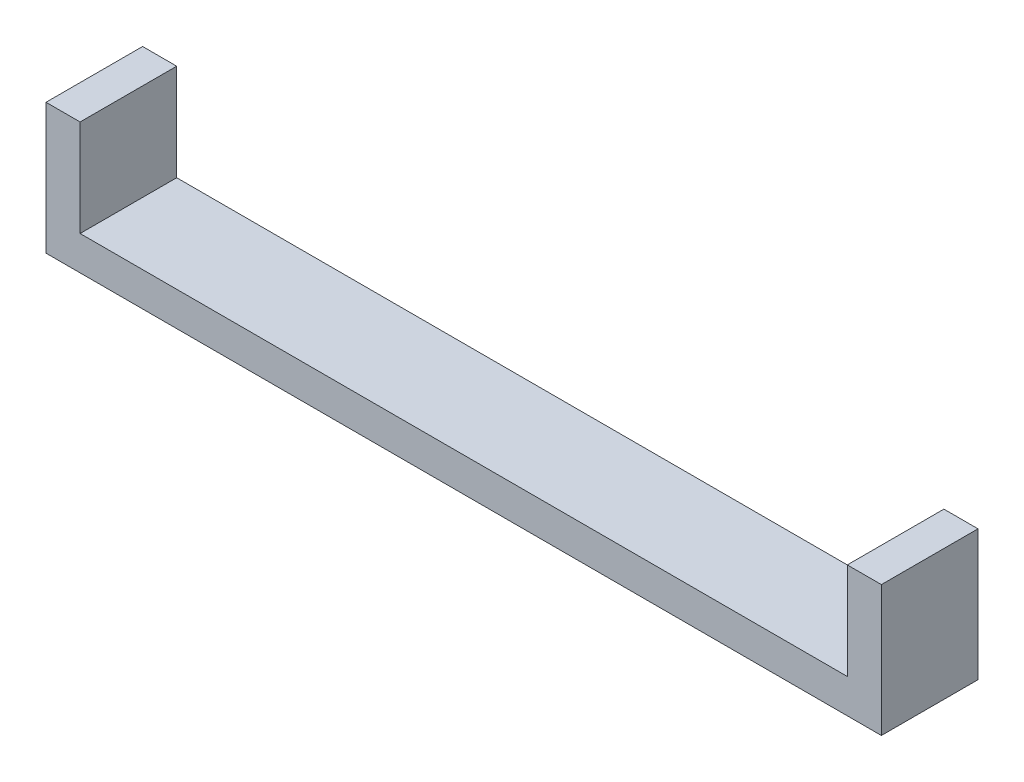
ISO-10303-21;
HEADER;
FILE_DESCRIPTION(('STEP AP214'),'2;1');
FILE_NAME('part.step','',(''),(''),'','','');
FILE_SCHEMA(('AUTOMOTIVE_DESIGN { 1 0 10303 214 1 1 1 1 }'));
ENDSEC;
DATA;
#1=APPLICATION_CONTEXT('core data for automotive mechanical design processes');
#2=APPLICATION_PROTOCOL_DEFINITION('international standard','automotive_design',2000,#1);
#3=PRODUCT_CONTEXT('',#1,'mechanical');
#4=PRODUCT('Part','Part','',(#3));
#5=PRODUCT_RELATED_PRODUCT_CATEGORY('part','',(#4));
#6=PRODUCT_DEFINITION_FORMATION('','',#4);
#7=PRODUCT_DEFINITION_CONTEXT('part definition',#1,'design');
#8=PRODUCT_DEFINITION('design','',#6,#7);
#9=PRODUCT_DEFINITION_SHAPE('','',#8);
#10=(LENGTH_UNIT() NAMED_UNIT(*) SI_UNIT(.MILLI.,.METRE.));
#11=(NAMED_UNIT(*) PLANE_ANGLE_UNIT() SI_UNIT($,.RADIAN.));
#12=(NAMED_UNIT(*) SI_UNIT($,.STERADIAN.) SOLID_ANGLE_UNIT());
#13=UNCERTAINTY_MEASURE_WITH_UNIT(LENGTH_MEASURE(1.E-05),#10,'distance_accuracy_value','');
#14=(GEOMETRIC_REPRESENTATION_CONTEXT(3) GLOBAL_UNCERTAINTY_ASSIGNED_CONTEXT((#13)) GLOBAL_UNIT_ASSIGNED_CONTEXT((#10,
#11,#12)) REPRESENTATION_CONTEXT('',''));
#15=CARTESIAN_POINT('',(0.,0.,0.));
#16=DIRECTION('',(0.,0.,1.));
#17=DIRECTION('',(1.,0.,0.));
#18=AXIS2_PLACEMENT_3D('',#15,#16,#17);
#19=CARTESIAN_POINT('',(5.,-4.25,-4.25));
#20=DIRECTION('',(0.,0.,1.));
#21=DIRECTION('',(1.,0.,0.));
#22=AXIS2_PLACEMENT_3D('',#19,#20,#21);
#23=PLANE('',#22);
#24=DIRECTION('',(1.,0.,0.));
#25=VECTOR('',#24,1.);
#26=CARTESIAN_POINT('',(-2.,-4.25,-4.25));
#27=LINE('',#26,#25);
#28=CARTESIAN_POINT('',(5.,-4.25,-4.25));
#29=VERTEX_POINT('',#28);
#30=CARTESIAN_POINT('',(72.5,-4.25,-4.25));
#31=VERTEX_POINT('',#30);
#32=EDGE_CURVE('E141',#29,#31,#27,.T.);
#33=ORIENTED_EDGE('',*,*,#32,.T.);
#34=DIRECTION('',(0.,-1.,0.));
#35=VECTOR('',#34,1.);
#36=CARTESIAN_POINT('',(72.5,15.2613577727726,-4.25));
#37=LINE('',#36,#35);
#38=CARTESIAN_POINT('',(72.5,4.25,-4.25));
#39=VERTEX_POINT('',#38);
#40=EDGE_CURVE('E187',#39,#31,#37,.T.);
#41=ORIENTED_EDGE('',*,*,#40,.F.);
#42=DIRECTION('',(1.,0.,0.));
#43=VECTOR('',#42,1.);
#44=CARTESIAN_POINT('',(79.5,4.25,-4.25));
#45=LINE('',#44,#43);
#46=CARTESIAN_POINT('',(75.5,4.25,-4.25));
#47=VERTEX_POINT('',#46);
#48=EDGE_CURVE('E145',#39,#47,#45,.T.);
#49=ORIENTED_EDGE('',*,*,#48,.T.);
#50=DIRECTION('',(0.,1.,0.));
#51=VECTOR('',#50,1.);
#52=CARTESIAN_POINT('',(75.5,4.25,-4.25));
#53=LINE('',#52,#51);
#54=CARTESIAN_POINT('',(75.5,-7.25,-4.25));
#55=VERTEX_POINT('',#54);
#56=EDGE_CURVE('E58',#55,#47,#53,.T.);
#57=ORIENTED_EDGE('',*,*,#56,.F.);
#58=DIRECTION('',(1.,0.,0.));
#59=VECTOR('',#58,1.);
#60=CARTESIAN_POINT('',(-2.,-7.25,-4.25));
#61=LINE('',#60,#59);
#62=CARTESIAN_POINT('',(2.,-7.25,-4.25));
#63=VERTEX_POINT('',#62);
#64=EDGE_CURVE('E122',#63,#55,#61,.T.);
#65=ORIENTED_EDGE('',*,*,#64,.F.);
#66=DIRECTION('',(0.,-1.,0.));
#67=VECTOR('',#66,1.);
#68=CARTESIAN_POINT('',(2.,4.25,-4.25));
#69=LINE('',#68,#67);
#70=CARTESIAN_POINT('',(2.,4.25,-4.25));
#71=VERTEX_POINT('',#70);
#72=EDGE_CURVE('E66',#71,#63,#69,.T.);
#73=ORIENTED_EDGE('',*,*,#72,.F.);
#74=DIRECTION('',(-1.,0.,0.));
#75=VECTOR('',#74,1.);
#76=CARTESIAN_POINT('',(5.,4.25,-4.25));
#77=LINE('',#76,#75);
#78=CARTESIAN_POINT('',(5.,4.25,-4.25));
#79=VERTEX_POINT('',#78);
#80=EDGE_CURVE('E11',#79,#71,#77,.T.);
#81=ORIENTED_EDGE('',*,*,#80,.F.);
#82=DIRECTION('',(0.,1.,0.));
#83=VECTOR('',#82,1.);
#84=CARTESIAN_POINT('',(5.,-4.25,-4.25));
#85=LINE('',#84,#83);
#86=EDGE_CURVE('E130',#29,#79,#85,.T.);
#87=ORIENTED_EDGE('',*,*,#86,.F.);
#88=EDGE_LOOP('',(#33,#41,#49,#57,#65,#73,#81,#87));
#89=FACE_BOUND('',#88,.T.);
#90=ADVANCED_FACE('F43',(#89),#23,.F.);
#91=CARTESIAN_POINT('',(5.,-4.25,4.25));
#92=DIRECTION('',(0.,0.,-1.));
#93=DIRECTION('',(-1.,0.,0.));
#94=AXIS2_PLACEMENT_3D('',#91,#92,#93);
#95=PLANE('',#94);
#96=DIRECTION('',(-1.,0.,0.));
#97=VECTOR('',#96,1.);
#98=CARTESIAN_POINT('',(-2.,-7.25,4.25));
#99=LINE('',#98,#97);
#100=CARTESIAN_POINT('',(75.5,-7.25,4.25));
#101=VERTEX_POINT('',#100);
#102=CARTESIAN_POINT('',(2.,-7.25,4.25));
#103=VERTEX_POINT('',#102);
#104=EDGE_CURVE('E120',#101,#103,#99,.T.);
#105=ORIENTED_EDGE('',*,*,#104,.F.);
#106=DIRECTION('',(0.,-1.,0.));
#107=VECTOR('',#106,1.);
#108=CARTESIAN_POINT('',(75.5,4.25,4.25));
#109=LINE('',#108,#107);
#110=CARTESIAN_POINT('',(75.5,4.25,4.25));
#111=VERTEX_POINT('',#110);
#112=EDGE_CURVE('E107',#111,#101,#109,.T.);
#113=ORIENTED_EDGE('',*,*,#112,.F.);
#114=DIRECTION('',(-1.,0.,0.));
#115=VECTOR('',#114,1.);
#116=CARTESIAN_POINT('',(79.5,4.25,4.25));
#117=LINE('',#116,#115);
#118=CARTESIAN_POINT('',(72.5,4.25,4.25));
#119=VERTEX_POINT('',#118);
#120=EDGE_CURVE('E181',#111,#119,#117,.T.);
#121=ORIENTED_EDGE('',*,*,#120,.T.);
#122=DIRECTION('',(0.,-1.,0.));
#123=VECTOR('',#122,1.);
#124=CARTESIAN_POINT('',(72.5,15.2613577727726,4.25));
#125=LINE('',#124,#123);
#126=CARTESIAN_POINT('',(72.5,-4.25,4.25));
#127=VERTEX_POINT('',#126);
#128=EDGE_CURVE('E171',#119,#127,#125,.T.);
#129=ORIENTED_EDGE('',*,*,#128,.T.);
#130=DIRECTION('',(-1.,0.,0.));
#131=VECTOR('',#130,1.);
#132=CARTESIAN_POINT('',(-2.,-4.25,4.25));
#133=LINE('',#132,#131);
#134=CARTESIAN_POINT('',(5.,-4.25,4.25));
#135=VERTEX_POINT('',#134);
#136=EDGE_CURVE('E137',#127,#135,#133,.T.);
#137=ORIENTED_EDGE('',*,*,#136,.T.);
#138=DIRECTION('',(0.,-1.,0.));
#139=VECTOR('',#138,1.);
#140=CARTESIAN_POINT('',(5.,-4.25,4.25));
#141=LINE('',#140,#139);
#142=CARTESIAN_POINT('',(5.,4.25,4.25));
#143=VERTEX_POINT('',#142);
#144=EDGE_CURVE('E150',#143,#135,#141,.T.);
#145=ORIENTED_EDGE('',*,*,#144,.F.);
#146=DIRECTION('',(-1.,0.,0.));
#147=VECTOR('',#146,1.);
#148=CARTESIAN_POINT('',(5.,4.25,4.25));
#149=LINE('',#148,#147);
#150=CARTESIAN_POINT('',(2.,4.25,4.25));
#151=VERTEX_POINT('',#150);
#152=EDGE_CURVE('E51',#143,#151,#149,.T.);
#153=ORIENTED_EDGE('',*,*,#152,.T.);
#154=DIRECTION('',(0.,1.,0.));
#155=VECTOR('',#154,1.);
#156=CARTESIAN_POINT('',(2.,4.25,4.25));
#157=LINE('',#156,#155);
#158=EDGE_CURVE('E128',#103,#151,#157,.T.);
#159=ORIENTED_EDGE('',*,*,#158,.F.);
#160=EDGE_LOOP('',(#105,#113,#121,#129,#137,#145,#153,#159));
#161=FACE_BOUND('',#160,.T.);
#162=ADVANCED_FACE('F126',(#161),#95,.F.);
#163=CARTESIAN_POINT('',(0.,-7.25,0.));
#164=DIRECTION('',(0.,-1.,0.));
#165=DIRECTION('',(0.,0.,-1.));
#166=AXIS2_PLACEMENT_3D('',#163,#164,#165);
#167=PLANE('',#166);
#168=ORIENTED_EDGE('',*,*,#64,.T.);
#169=DIRECTION('',(0.,0.,-1.));
#170=VECTOR('',#169,1.);
#171=CARTESIAN_POINT('',(75.5,-7.25,4.25));
#172=LINE('',#171,#170);
#173=EDGE_CURVE('E110',#101,#55,#172,.T.);
#174=ORIENTED_EDGE('',*,*,#173,.F.);
#175=ORIENTED_EDGE('',*,*,#104,.T.);
#176=DIRECTION('',(0.,0.,1.));
#177=VECTOR('',#176,1.);
#178=CARTESIAN_POINT('',(2.,-7.25,-4.25));
#179=LINE('',#178,#177);
#180=EDGE_CURVE('E173',#63,#103,#179,.T.);
#181=ORIENTED_EDGE('',*,*,#180,.F.);
#182=EDGE_LOOP('',(#168,#174,#175,#181));
#183=FACE_BOUND('',#182,.T.);
#184=ADVANCED_FACE('F119',(#183),#167,.T.);
#185=CARTESIAN_POINT('',(5.,4.25,4.25));
#186=DIRECTION('',(0.,-1.,0.));
#187=DIRECTION('',(0.,0.,-1.));
#188=AXIS2_PLACEMENT_3D('',#185,#186,#187);
#189=PLANE('',#188);
#190=DIRECTION('',(0.,0.,1.));
#191=VECTOR('',#190,1.);
#192=CARTESIAN_POINT('',(75.5,4.25,4.25));
#193=LINE('',#192,#191);
#194=EDGE_CURVE('E111',#47,#111,#193,.T.);
#195=ORIENTED_EDGE('',*,*,#194,.F.);
#196=ORIENTED_EDGE('',*,*,#48,.F.);
#197=DIRECTION('',(0.,0.,-1.));
#198=VECTOR('',#197,1.);
#199=CARTESIAN_POINT('',(72.5,4.25,-4.25));
#200=LINE('',#199,#198);
#201=EDGE_CURVE('E177',#119,#39,#200,.T.);
#202=ORIENTED_EDGE('',*,*,#201,.F.);
#203=ORIENTED_EDGE('',*,*,#120,.F.);
#204=EDGE_LOOP('',(#195,#196,#202,#203));
#205=FACE_BOUND('',#204,.T.);
#206=ADVANCED_FACE('F193',(#205),#189,.F.);
#207=CARTESIAN_POINT('',(5.,4.25,4.25));
#208=DIRECTION('',(0.,-1.,0.));
#209=DIRECTION('',(0.,0.,-1.));
#210=AXIS2_PLACEMENT_3D('',#207,#208,#209);
#211=PLANE('',#210);
#212=DIRECTION('',(0.,0.,-1.));
#213=VECTOR('',#212,1.);
#214=CARTESIAN_POINT('',(2.,4.25,-4.25));
#215=LINE('',#214,#213);
#216=EDGE_CURVE('E163',#151,#71,#215,.T.);
#217=ORIENTED_EDGE('',*,*,#216,.F.);
#218=ORIENTED_EDGE('',*,*,#152,.F.);
#219=DIRECTION('',(0.,0.,1.));
#220=VECTOR('',#219,1.);
#221=CARTESIAN_POINT('',(5.,4.25,4.25));
#222=LINE('',#221,#220);
#223=EDGE_CURVE('E135',#79,#143,#222,.T.);
#224=ORIENTED_EDGE('',*,*,#223,.F.);
#225=ORIENTED_EDGE('',*,*,#80,.T.);
#226=EDGE_LOOP('',(#217,#218,#224,#225));
#227=FACE_BOUND('',#226,.T.);
#228=ADVANCED_FACE('F162',(#227),#211,.F.);
#229=CARTESIAN_POINT('',(0.,-4.25,0.));
#230=DIRECTION('',(0.,-1.,0.));
#231=DIRECTION('',(0.,0.,-1.));
#232=AXIS2_PLACEMENT_3D('',#229,#230,#231);
#233=PLANE('',#232);
#234=DIRECTION('',(0.,0.,1.));
#235=VECTOR('',#234,1.);
#236=CARTESIAN_POINT('',(72.5,-4.25,-4.25));
#237=LINE('',#236,#235);
#238=EDGE_CURVE('E166',#31,#127,#237,.T.);
#239=ORIENTED_EDGE('',*,*,#238,.F.);
#240=ORIENTED_EDGE('',*,*,#32,.F.);
#241=DIRECTION('',(0.,0.,-1.));
#242=VECTOR('',#241,1.);
#243=CARTESIAN_POINT('',(5.,-4.25,4.25));
#244=LINE('',#243,#242);
#245=EDGE_CURVE('E154',#135,#29,#244,.T.);
#246=ORIENTED_EDGE('',*,*,#245,.F.);
#247=ORIENTED_EDGE('',*,*,#136,.F.);
#248=EDGE_LOOP('',(#239,#240,#246,#247));
#249=FACE_BOUND('',#248,.T.);
#250=ADVANCED_FACE('F201',(#249),#233,.F.);
#251=CARTESIAN_POINT('',(5.,0.,0.));
#252=DIRECTION('',(-1.,0.,0.));
#253=DIRECTION('',(0.,0.,1.));
#254=AXIS2_PLACEMENT_3D('',#251,#252,#253);
#255=PLANE('',#254);
#256=ORIENTED_EDGE('',*,*,#86,.T.);
#257=ORIENTED_EDGE('',*,*,#223,.T.);
#258=ORIENTED_EDGE('',*,*,#144,.T.);
#259=ORIENTED_EDGE('',*,*,#245,.T.);
#260=EDGE_LOOP('',(#256,#257,#258,#259));
#261=FACE_BOUND('',#260,.T.);
#262=ADVANCED_FACE('F204',(#261),#255,.F.);
#263=CARTESIAN_POINT('',(72.5,15.2613577727726,-4.25));
#264=DIRECTION('',(1.,0.,0.));
#265=DIRECTION('',(0.,0.,-1.));
#266=AXIS2_PLACEMENT_3D('',#263,#264,#265);
#267=PLANE('',#266);
#268=ORIENTED_EDGE('',*,*,#128,.F.);
#269=ORIENTED_EDGE('',*,*,#201,.T.);
#270=ORIENTED_EDGE('',*,*,#40,.T.);
#271=ORIENTED_EDGE('',*,*,#238,.T.);
#272=EDGE_LOOP('',(#268,#269,#270,#271));
#273=FACE_BOUND('',#272,.T.);
#274=ADVANCED_FACE('F196',(#273),#267,.F.);
#275=CARTESIAN_POINT('',(2.,0.,0.));
#276=DIRECTION('',(-1.,0.,0.));
#277=DIRECTION('',(0.,0.,1.));
#278=AXIS2_PLACEMENT_3D('',#275,#276,#277);
#279=PLANE('',#278);
#280=ORIENTED_EDGE('',*,*,#158,.T.);
#281=ORIENTED_EDGE('',*,*,#216,.T.);
#282=ORIENTED_EDGE('',*,*,#72,.T.);
#283=ORIENTED_EDGE('',*,*,#180,.T.);
#284=EDGE_LOOP('',(#280,#281,#282,#283));
#285=FACE_BOUND('',#284,.T.);
#286=ADVANCED_FACE('F213',(#285),#279,.T.);
#287=CARTESIAN_POINT('',(75.5,0.,0.));
#288=DIRECTION('',(1.,0.,0.));
#289=DIRECTION('',(0.,0.,-1.));
#290=AXIS2_PLACEMENT_3D('',#287,#288,#289);
#291=PLANE('',#290);
#292=ORIENTED_EDGE('',*,*,#56,.T.);
#293=ORIENTED_EDGE('',*,*,#194,.T.);
#294=ORIENTED_EDGE('',*,*,#112,.T.);
#295=ORIENTED_EDGE('',*,*,#173,.T.);
#296=EDGE_LOOP('',(#292,#293,#294,#295));
#297=FACE_BOUND('',#296,.T.);
#298=ADVANCED_FACE('F109',(#297),#291,.T.);
#299=CLOSED_SHELL('',(#90,#162,#184,#206,#228,#250,#262,#274,#286,#298));
#300=MANIFOLD_SOLID_BREP('B2',#299);
#301=ADVANCED_BREP_SHAPE_REPRESENTATION('',(#18,#300),#14);
#302=SHAPE_DEFINITION_REPRESENTATION(#9,#301);
ENDSEC;
END-ISO-10303-21;
